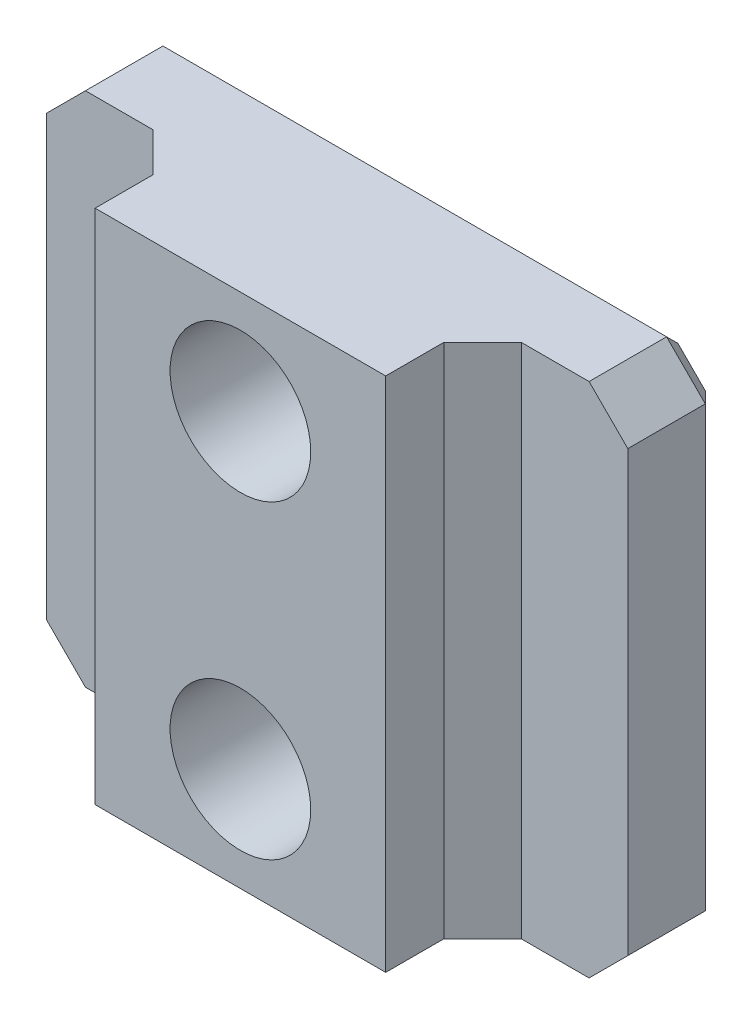
ISO-10303-21;
HEADER;
FILE_DESCRIPTION(('STEP AP214'),'2;1');
FILE_NAME('part.step','',(''),(''),'','','');
FILE_SCHEMA(('AUTOMOTIVE_DESIGN { 1 0 10303 214 1 1 1 1 }'));
ENDSEC;
DATA;
#1=APPLICATION_CONTEXT('core data for automotive mechanical design processes');
#2=APPLICATION_PROTOCOL_DEFINITION('international standard','automotive_design',2000,#1);
#3=PRODUCT_CONTEXT('',#1,'mechanical');
#4=PRODUCT('Part','Part','',(#3));
#5=PRODUCT_RELATED_PRODUCT_CATEGORY('part','',(#4));
#6=PRODUCT_DEFINITION_FORMATION('','',#4);
#7=PRODUCT_DEFINITION_CONTEXT('part definition',#1,'design');
#8=PRODUCT_DEFINITION('design','',#6,#7);
#9=PRODUCT_DEFINITION_SHAPE('','',#8);
#10=(LENGTH_UNIT() NAMED_UNIT(*) SI_UNIT(.MILLI.,.METRE.));
#11=(NAMED_UNIT(*) PLANE_ANGLE_UNIT() SI_UNIT($,.RADIAN.));
#12=(NAMED_UNIT(*) SI_UNIT($,.STERADIAN.) SOLID_ANGLE_UNIT());
#13=UNCERTAINTY_MEASURE_WITH_UNIT(LENGTH_MEASURE(1.E-05),#10,'distance_accuracy_value','');
#14=(GEOMETRIC_REPRESENTATION_CONTEXT(3) GLOBAL_UNCERTAINTY_ASSIGNED_CONTEXT((#13)) GLOBAL_UNIT_ASSIGNED_CONTEXT((#10,
#11,#12)) REPRESENTATION_CONTEXT('',''));
#15=CARTESIAN_POINT('',(0.,0.,0.));
#16=DIRECTION('',(0.,0.,1.));
#17=DIRECTION('',(1.,0.,0.));
#18=AXIS2_PLACEMENT_3D('',#15,#16,#17);
#19=CARTESIAN_POINT('',(0.,7.49400541621981E-13,12.6999999999996));
#20=DIRECTION('',(0.,0.,1.));
#21=DIRECTION('',(1.,0.,0.));
#22=AXIS2_PLACEMENT_3D('',#19,#20,#21);
#23=PLANE('',#22);
#24=DIRECTION('',(0.,-1.,0.));
#25=VECTOR('',#24,1.);
#26=CARTESIAN_POINT('',(-114.479465969192,38.3462946899985,12.6999999999998));
#27=LINE('',#26,#25);
#28=CARTESIAN_POINT('',(-114.479465969192,38.3462946899985,12.6999999999998));
#29=VERTEX_POINT('',#28);
#30=CARTESIAN_POINT('',(-114.479465969192,4.47870530998759,12.6999999999979));
#31=VERTEX_POINT('',#30);
#32=EDGE_CURVE('E166',#29,#31,#27,.T.);
#33=ORIENTED_EDGE('',*,*,#32,.F.);
#34=DIRECTION('',(-1.,0.,0.));
#35=VECTOR('',#34,1.);
#36=CARTESIAN_POINT('',(-104.954465969192,38.3462946899983,12.6999999999979));
#37=LINE('',#36,#35);
#38=CARTESIAN_POINT('',(-133.529465969192,38.3462946899986,12.6999999999999));
#39=VERTEX_POINT('',#38);
#40=EDGE_CURVE('E180',#29,#39,#37,.T.);
#41=ORIENTED_EDGE('',*,*,#40,.T.);
#42=DIRECTION('',(0.,-1.,0.));
#43=VECTOR('',#42,1.);
#44=CARTESIAN_POINT('',(-133.529465969192,38.3462946899989,12.6999999999998));
#45=LINE('',#44,#43);
#46=CARTESIAN_POINT('',(-133.529465969192,4.47870530998753,12.6999999999993));
#47=VERTEX_POINT('',#46);
#48=EDGE_CURVE('E318',#39,#47,#45,.T.);
#49=ORIENTED_EDGE('',*,*,#48,.T.);
#50=DIRECTION('',(1.,0.,0.));
#51=VECTOR('',#50,1.);
#52=CARTESIAN_POINT('',(-143.054465969192,4.47870530998777,12.7));
#53=LINE('',#52,#51);
#54=EDGE_CURVE('E182',#47,#31,#53,.T.);
#55=ORIENTED_EDGE('',*,*,#54,.T.);
#56=EDGE_LOOP('',(#33,#41,#49,#55));
#57=FACE_BOUND('',#56,.T.);
#58=CARTESIAN_POINT('',(-124.004465969192,11.2524999999869,12.6999999999991));
#59=DIRECTION('',(0.,0.,1.));
#60=DIRECTION('',(1.,0.,0.));
#61=AXIS2_PLACEMENT_3D('',#58,#59,#60);
#62=CIRCLE('',#61,4.61010000000002);
#63=CARTESIAN_POINT('',(-119.394365969192,11.2524999999869,12.6999999999991));
#64=VERTEX_POINT('',#63);
#65=EDGE_CURVE('E320',#64,#64,#62,.T.);
#66=ORIENTED_EDGE('',*,*,#65,.F.);
#67=EDGE_LOOP('',(#66));
#68=FACE_BOUND('',#67,.T.);
#69=CARTESIAN_POINT('',(-124.004465969192,31.5724999999854,12.6999999999983));
#70=DIRECTION('',(0.,0.,1.));
#71=DIRECTION('',(1.,0.,0.));
#72=AXIS2_PLACEMENT_3D('',#69,#70,#71);
#73=CIRCLE('',#72,4.61010000000002);
#74=CARTESIAN_POINT('',(-119.394365969192,31.5724999999854,12.6999999999983));
#75=VERTEX_POINT('',#74);
#76=EDGE_CURVE('E205',#75,#75,#73,.T.);
#77=ORIENTED_EDGE('',*,*,#76,.F.);
#78=EDGE_LOOP('',(#77));
#79=FACE_BOUND('',#78,.T.);
#80=ADVANCED_FACE('F36',(#57,#68,#79),#23,.T.);
#81=CARTESIAN_POINT('',(0.,0.,0.));
#82=DIRECTION('',(0.,0.,1.));
#83=DIRECTION('',(1.,0.,0.));
#84=AXIS2_PLACEMENT_3D('',#81,#82,#83);
#85=PLANE('',#84);
#86=DIRECTION('',(-1.,0.,0.));
#87=VECTOR('',#86,1.);
#88=CARTESIAN_POINT('',(0.,5.74870530998726,-3.88578058618805E-13));
#89=LINE('',#88,#87);
#90=CARTESIAN_POINT('',(-108.020517193406,5.74870530998775,2.77555756156289E-13));
#91=VERTEX_POINT('',#90);
#92=CARTESIAN_POINT('',(-139.988414744978,5.74870530998783,-1.02695629777827E-12));
#93=VERTEX_POINT('',#92);
#94=EDGE_CURVE('E259',#91,#93,#89,.T.);
#95=ORIENTED_EDGE('',*,*,#94,.T.);
#96=DIRECTION('',(-0.70710678118655,0.707106781186547,0.));
#97=VECTOR('',#96,1.);
#98=CARTESIAN_POINT('',(-142.156440357085,7.91673092209599,-1.69309011255336E-12));
#99=LINE('',#98,#97);
#100=CARTESIAN_POINT('',(-141.784465969192,7.54475653420246,-1.27675647831893E-12));
#101=VERTEX_POINT('',#100);
#102=EDGE_CURVE('E261',#93,#101,#99,.T.);
#103=ORIENTED_EDGE('',*,*,#102,.T.);
#104=DIRECTION('',(0.,1.,0.));
#105=VECTOR('',#104,1.);
#106=CARTESIAN_POINT('',(-141.784465969192,0.,0.));
#107=LINE('',#106,#105);
#108=CARTESIAN_POINT('',(-141.784465969192,35.2802434657848,-2.4980018054066E-12));
#109=VERTEX_POINT('',#108);
#110=EDGE_CURVE('E247',#101,#109,#107,.T.);
#111=ORIENTED_EDGE('',*,*,#110,.T.);
#112=DIRECTION('',(0.707106781186548,0.707106781186548,0.));
#113=VECTOR('',#112,1.);
#114=CARTESIAN_POINT('',(-139.616440357085,37.4482690778922,0.));
#115=LINE('',#114,#113);
#116=CARTESIAN_POINT('',(-139.988414744978,37.0762946900003,-9.99200722162641E-13));
#117=VERTEX_POINT('',#116);
#118=EDGE_CURVE('E249',#109,#117,#115,.T.);
#119=ORIENTED_EDGE('',*,*,#118,.T.);
#120=DIRECTION('',(1.,0.,0.));
#121=VECTOR('',#120,1.);
#122=CARTESIAN_POINT('',(0.,37.0762946899989,-1.16573417585641E-12));
#123=LINE('',#122,#121);
#124=CARTESIAN_POINT('',(-108.020517193406,37.0762946899994,-8.88178419700125E-13));
#125=VERTEX_POINT('',#124);
#126=EDGE_CURVE('E251',#117,#125,#123,.T.);
#127=ORIENTED_EDGE('',*,*,#126,.T.);
#128=DIRECTION('',(0.707106781186545,-0.707106781186547,0.));
#129=VECTOR('',#128,1.);
#130=CARTESIAN_POINT('',(-105.852491581299,34.9082690778918,-1.11022302462516E-13));
#131=LINE('',#130,#129);
#132=CARTESIAN_POINT('',(-106.224465969192,35.2802434657849,-1.33226762955019E-12));
#133=VERTEX_POINT('',#132);
#134=EDGE_CURVE('E253',#125,#133,#131,.T.);
#135=ORIENTED_EDGE('',*,*,#134,.T.);
#136=DIRECTION('',(0.,-1.,0.));
#137=VECTOR('',#136,1.);
#138=CARTESIAN_POINT('',(-106.224465969192,-1.2490009027033E-13,4.71844785465692E-13));
#139=LINE('',#138,#137);
#140=CARTESIAN_POINT('',(-106.224465969192,7.54475653420256,-2.22044604925031E-13));
#141=VERTEX_POINT('',#140);
#142=EDGE_CURVE('E255',#133,#141,#139,.T.);
#143=ORIENTED_EDGE('',*,*,#142,.T.);
#144=DIRECTION('',(-0.707106781186551,-0.707106781186547,0.));
#145=VECTOR('',#144,1.);
#146=CARTESIAN_POINT('',(-108.392491581299,5.37673092209461,-1.08246744900953E-12));
#147=LINE('',#146,#145);
#148=EDGE_CURVE('E257',#141,#91,#147,.T.);
#149=ORIENTED_EDGE('',*,*,#148,.T.);
#150=EDGE_LOOP('',(#95,#103,#111,#119,#127,#135,#143,#149));
#151=FACE_BOUND('',#150,.T.);
#152=CARTESIAN_POINT('',(-124.004465969192,11.252499999985,-1.94289029309402E-13));
#153=DIRECTION('',(0.,0.,-1.));
#154=DIRECTION('',(-1.,0.,0.));
#155=AXIS2_PLACEMENT_3D('',#152,#153,#154);
#156=CIRCLE('',#155,3.57123999999999);
#157=CARTESIAN_POINT('',(-127.575705969192,11.252499999985,-1.92504836515894E-13));
#158=VERTEX_POINT('',#157);
#159=EDGE_CURVE('E201',#158,#158,#156,.T.);
#160=ORIENTED_EDGE('',*,*,#159,.F.);
#161=EDGE_LOOP('',(#160));
#162=FACE_BOUND('',#161,.T.);
#163=CARTESIAN_POINT('',(-124.004465969192,31.5724999999853,-6.10622663543836E-13));
#164=DIRECTION('',(0.,0.,-1.));
#165=DIRECTION('',(-1.,0.,0.));
#166=AXIS2_PLACEMENT_3D('',#163,#164,#165);
#167=CIRCLE('',#166,3.57123999999999);
#168=CARTESIAN_POINT('',(-127.575705969192,31.5724999999853,-6.08838470750328E-13));
#169=VERTEX_POINT('',#168);
#170=EDGE_CURVE('E194',#169,#169,#167,.T.);
#171=ORIENTED_EDGE('',*,*,#170,.F.);
#172=EDGE_LOOP('',(#171));
#173=FACE_BOUND('',#172,.T.);
#174=ADVANCED_FACE('F335',(#151,#162,#173),#85,.F.);
#175=CARTESIAN_POINT('',(-143.054465969192,38.3462946899986,12.7000000000011));
#176=DIRECTION('',(1.,0.,0.));
#177=DIRECTION('',(0.,1.,0.));
#178=AXIS2_PLACEMENT_3D('',#175,#176,#177);
#179=PLANE('',#178);
#180=DIRECTION('',(0.,0.,-1.));
#181=VECTOR('',#180,1.);
#182=CARTESIAN_POINT('',(-143.054465969192,35.8062946899993,12.7000000000007));
#183=LINE('',#182,#181);
#184=CARTESIAN_POINT('',(-143.054465969192,35.8062946899999,6.35000000000072));
#185=VERTEX_POINT('',#184);
#186=CARTESIAN_POINT('',(-143.054465969192,35.8062946899996,1.27000000000116));
#187=VERTEX_POINT('',#186);
#188=EDGE_CURVE('E223',#185,#187,#183,.T.);
#189=ORIENTED_EDGE('',*,*,#188,.T.);
#190=DIRECTION('',(0.,-1.,0.));
#191=VECTOR('',#190,1.);
#192=CARTESIAN_POINT('',(-143.054465969192,38.346294689999,1.2700000000006));
#193=LINE('',#192,#191);
#194=CARTESIAN_POINT('',(-143.054465969192,7.01870530998842,1.27000000000022));
#195=VERTEX_POINT('',#194);
#196=EDGE_CURVE('E11',#187,#195,#193,.T.);
#197=ORIENTED_EDGE('',*,*,#196,.T.);
#198=DIRECTION('',(0.,0.,1.));
#199=VECTOR('',#198,1.);
#200=CARTESIAN_POINT('',(-143.054465969192,7.01870530998841,12.7000000000002));
#201=LINE('',#200,#199);
#202=CARTESIAN_POINT('',(-143.054465969192,7.0187053099893,6.35000000000074));
#203=VERTEX_POINT('',#202);
#204=EDGE_CURVE('E221',#195,#203,#201,.T.);
#205=ORIENTED_EDGE('',*,*,#204,.T.);
#206=DIRECTION('',(0.,-1.,0.));
#207=VECTOR('',#206,1.);
#208=CARTESIAN_POINT('',(-143.054465969192,38.3462946899989,6.35000000000027));
#209=LINE('',#208,#207);
#210=EDGE_CURVE('E314',#185,#203,#209,.T.);
#211=ORIENTED_EDGE('',*,*,#210,.F.);
#212=EDGE_LOOP('',(#189,#197,#205,#211));
#213=FACE_BOUND('',#212,.T.);
#214=ADVANCED_FACE('F337',(#213),#179,.F.);
#215=CARTESIAN_POINT('',(-143.054465969192,4.47870530998777,12.7));
#216=DIRECTION('',(0.,1.,0.));
#217=DIRECTION('',(-1.,0.,0.));
#218=AXIS2_PLACEMENT_3D('',#215,#216,#217);
#219=PLANE('',#218);
#220=DIRECTION('',(0.,0.,-1.));
#221=VECTOR('',#220,1.);
#222=CARTESIAN_POINT('',(-140.514465969192,4.4787053099877,12.6999999999979));
#223=LINE('',#222,#221);
#224=CARTESIAN_POINT('',(-140.514465969192,4.47870530998772,6.34999999999836));
#225=VERTEX_POINT('',#224);
#226=CARTESIAN_POINT('',(-140.514465969192,4.47870530998799,1.26999999999949));
#227=VERTEX_POINT('',#226);
#228=EDGE_CURVE('E236',#225,#227,#223,.T.);
#229=ORIENTED_EDGE('',*,*,#228,.T.);
#230=DIRECTION('',(1.,0.,0.));
#231=VECTOR('',#230,1.);
#232=CARTESIAN_POINT('',(-143.054465969192,4.47870530998802,1.27000000000077));
#233=LINE('',#232,#231);
#234=CARTESIAN_POINT('',(-107.494465969192,4.47870530998781,1.26999999999999));
#235=VERTEX_POINT('',#234);
#236=EDGE_CURVE('E267',#227,#235,#233,.T.);
#237=ORIENTED_EDGE('',*,*,#236,.T.);
#238=DIRECTION('',(0.,0.,1.));
#239=VECTOR('',#238,1.);
#240=CARTESIAN_POINT('',(-107.494465969192,4.47870530998759,12.6999999999999));
#241=LINE('',#240,#239);
#242=CARTESIAN_POINT('',(-107.494465969192,4.4787053099879,6.35000000000002));
#243=VERTEX_POINT('',#242);
#244=EDGE_CURVE('E234',#235,#243,#241,.T.);
#245=ORIENTED_EDGE('',*,*,#244,.T.);
#246=DIRECTION('',(1.,0.,0.));
#247=VECTOR('',#246,1.);
#248=CARTESIAN_POINT('',(-104.954465969192,4.47870530998756,6.34999999999752));
#249=LINE('',#248,#247);
#250=CARTESIAN_POINT('',(-111.939465969192,4.47870530998766,6.3499999999983));
#251=VERTEX_POINT('',#250);
#252=EDGE_CURVE('E173',#251,#243,#249,.T.);
#253=ORIENTED_EDGE('',*,*,#252,.F.);
#254=DIRECTION('',(0.707106781186553,0.,-0.707106781186548));
#255=VECTOR('',#254,1.);
#256=CARTESIAN_POINT('',(-130.671965969192,4.47870530998866,25.0825000000007));
#257=LINE('',#256,#255);
#258=CARTESIAN_POINT('',(-114.479465969192,4.47870530998747,8.88999999999846));
#259=VERTEX_POINT('',#258);
#260=EDGE_CURVE('E243',#251,#259,#257,.F.);
#261=ORIENTED_EDGE('',*,*,#260,.T.);
#262=DIRECTION('',(0.,0.,-1.));
#263=VECTOR('',#262,1.);
#264=CARTESIAN_POINT('',(-114.479465969192,4.47870530998769,6.34999999999825));
#265=LINE('',#264,#263);
#266=EDGE_CURVE('E317',#31,#259,#265,.T.);
#267=ORIENTED_EDGE('',*,*,#266,.F.);
#268=ORIENTED_EDGE('',*,*,#54,.F.);
#269=DIRECTION('',(0.,0.,1.));
#270=VECTOR('',#269,1.);
#271=CARTESIAN_POINT('',(-133.529465969192,4.4787053099879,6.35000000000002));
#272=LINE('',#271,#270);
#273=CARTESIAN_POINT('',(-133.529465969192,4.47870530998788,8.89000000000001));
#274=VERTEX_POINT('',#273);
#275=EDGE_CURVE('E304',#274,#47,#272,.T.);
#276=ORIENTED_EDGE('',*,*,#275,.F.);
#277=DIRECTION('',(0.707106781186545,0.,0.70710678118655));
#278=VECTOR('',#277,1.);
#279=CARTESIAN_POINT('',(-136.386965969192,4.47870530998792,6.03249999999966));
#280=LINE('',#279,#278);
#281=CARTESIAN_POINT('',(-136.069465969192,4.47870530998797,6.35000000000019));
#282=VERTEX_POINT('',#281);
#283=EDGE_CURVE('E239',#274,#282,#280,.F.);
#284=ORIENTED_EDGE('',*,*,#283,.T.);
#285=DIRECTION('',(1.,0.,0.));
#286=VECTOR('',#285,1.);
#287=CARTESIAN_POINT('',(-143.054465969192,4.47870530998798,6.35000000000063));
#288=LINE('',#287,#286);
#289=EDGE_CURVE('E298',#225,#282,#288,.T.);
#290=ORIENTED_EDGE('',*,*,#289,.F.);
#291=EDGE_LOOP('',(#229,#237,#245,#253,#261,#267,#268,#276,#284,#290));
#292=FACE_BOUND('',#291,.T.);
#293=ADVANCED_FACE('F344',(#292),#219,.F.);
#294=CARTESIAN_POINT('',(-104.954465969192,4.47870530998741,12.6999999999977));
#295=DIRECTION('',(-1.,0.,0.));
#296=DIRECTION('',(0.,-1.,0.));
#297=AXIS2_PLACEMENT_3D('',#294,#295,#296);
#298=PLANE('',#297);
#299=DIRECTION('',(0.,0.,-1.));
#300=VECTOR('',#299,1.);
#301=CARTESIAN_POINT('',(-104.954465969192,7.01870530998872,12.6999999999975));
#302=LINE('',#301,#300);
#303=CARTESIAN_POINT('',(-104.954465969192,7.01870530998912,6.34999999999852));
#304=VERTEX_POINT('',#303);
#305=CARTESIAN_POINT('',(-104.954465969192,7.01870530998819,1.26999999999755));
#306=VERTEX_POINT('',#305);
#307=EDGE_CURVE('E229',#304,#306,#302,.T.);
#308=ORIENTED_EDGE('',*,*,#307,.T.);
#309=DIRECTION('',(0.,1.,0.));
#310=VECTOR('',#309,1.);
#311=CARTESIAN_POINT('',(-104.954465969192,4.47870530998763,1.26999999999794));
#312=LINE('',#311,#310);
#313=CARTESIAN_POINT('',(-104.954465969192,35.8062946899996,1.26999999999849));
#314=VERTEX_POINT('',#313);
#315=EDGE_CURVE('E271',#306,#314,#312,.T.);
#316=ORIENTED_EDGE('',*,*,#315,.T.);
#317=DIRECTION('',(0.,0.,1.));
#318=VECTOR('',#317,1.);
#319=CARTESIAN_POINT('',(-104.954465969192,35.806294689999,12.699999999999));
#320=LINE('',#319,#318);
#321=CARTESIAN_POINT('',(-104.954465969192,35.8062946900001,6.3499999999983));
#322=VERTEX_POINT('',#321);
#323=EDGE_CURVE('E232',#314,#322,#320,.T.);
#324=ORIENTED_EDGE('',*,*,#323,.T.);
#325=DIRECTION('',(0.,-1.,0.));
#326=VECTOR('',#325,1.);
#327=CARTESIAN_POINT('',(-104.954465969192,38.3462946899987,6.34999999999847));
#328=LINE('',#327,#326);
#329=EDGE_CURVE('E183',#322,#304,#328,.T.);
#330=ORIENTED_EDGE('',*,*,#329,.T.);
#331=EDGE_LOOP('',(#308,#316,#324,#330));
#332=FACE_BOUND('',#331,.T.);
#333=ADVANCED_FACE('F353',(#332),#298,.F.);
#334=CARTESIAN_POINT('',(-104.954465969192,38.3462946899983,12.6999999999979));
#335=DIRECTION('',(0.,-1.,0.));
#336=DIRECTION('',(1.,0.,0.));
#337=AXIS2_PLACEMENT_3D('',#334,#335,#336);
#338=PLANE('',#337);
#339=DIRECTION('',(0.,0.,-1.));
#340=VECTOR('',#339,1.);
#341=CARTESIAN_POINT('',(-107.494465969192,38.3462946899985,12.7000000000001));
#342=LINE('',#341,#340);
#343=CARTESIAN_POINT('',(-107.494465969192,38.3462946899986,6.35000000000022));
#344=VERTEX_POINT('',#343);
#345=CARTESIAN_POINT('',(-107.494465969192,38.3462946899987,1.2700000000001));
#346=VERTEX_POINT('',#345);
#347=EDGE_CURVE('E225',#344,#346,#342,.T.);
#348=ORIENTED_EDGE('',*,*,#347,.T.);
#349=DIRECTION('',(-1.,0.,0.));
#350=VECTOR('',#349,1.);
#351=CARTESIAN_POINT('',(-104.954465969192,38.3462946899988,1.26999999999994));
#352=LINE('',#351,#350);
#353=CARTESIAN_POINT('',(-140.514465969192,38.3462946899992,1.2700000000001));
#354=VERTEX_POINT('',#353);
#355=EDGE_CURVE('E60',#346,#354,#352,.T.);
#356=ORIENTED_EDGE('',*,*,#355,.T.);
#357=DIRECTION('',(0.,0.,1.));
#358=VECTOR('',#357,1.);
#359=CARTESIAN_POINT('',(-140.514465969192,38.3462946899984,12.6999999999984));
#360=LINE('',#359,#358);
#361=CARTESIAN_POINT('',(-140.514465969192,38.3462946899988,6.34999999999997));
#362=VERTEX_POINT('',#361);
#363=EDGE_CURVE('E227',#354,#362,#360,.T.);
#364=ORIENTED_EDGE('',*,*,#363,.T.);
#365=DIRECTION('',(1.,0.,0.));
#366=VECTOR('',#365,1.);
#367=CARTESIAN_POINT('',(-143.054465969192,38.3462946899989,6.35000000000027));
#368=LINE('',#367,#366);
#369=CARTESIAN_POINT('',(-136.069465969192,38.346294689999,6.3499999999998));
#370=VERTEX_POINT('',#369);
#371=EDGE_CURVE('E309',#362,#370,#368,.T.);
#372=ORIENTED_EDGE('',*,*,#371,.T.);
#373=DIRECTION('',(-0.707106781186545,0.,-0.70710678118655));
#374=VECTOR('',#373,1.);
#375=CARTESIAN_POINT('',(-117.336965969192,38.3462946899998,25.0824999999983));
#376=LINE('',#375,#374);
#377=CARTESIAN_POINT('',(-133.529465969192,38.3462946899986,8.89000000000001));
#378=VERTEX_POINT('',#377);
#379=EDGE_CURVE('E241',#370,#378,#376,.F.);
#380=ORIENTED_EDGE('',*,*,#379,.T.);
#381=DIRECTION('',(0.,0.,1.));
#382=VECTOR('',#381,1.);
#383=CARTESIAN_POINT('',(-133.529465969192,38.3462946899986,6.35000000000027));
#384=LINE('',#383,#382);
#385=EDGE_CURVE('E187',#378,#39,#384,.T.);
#386=ORIENTED_EDGE('',*,*,#385,.T.);
#387=ORIENTED_EDGE('',*,*,#40,.F.);
#388=DIRECTION('',(0.,0.,-1.));
#389=VECTOR('',#388,1.);
#390=CARTESIAN_POINT('',(-114.479465969192,38.3462946899988,6.35000000000013));
#391=LINE('',#390,#389);
#392=CARTESIAN_POINT('',(-114.479465969192,38.3462946899984,8.88999999999862));
#393=VERTEX_POINT('',#392);
#394=EDGE_CURVE('E162',#29,#393,#391,.T.);
#395=ORIENTED_EDGE('',*,*,#394,.T.);
#396=DIRECTION('',(-0.707106781186553,0.,0.707106781186548));
#397=VECTOR('',#396,1.);
#398=CARTESIAN_POINT('',(-111.621965969192,38.3462946899985,6.03249999999883));
#399=LINE('',#398,#397);
#400=CARTESIAN_POINT('',(-111.939465969192,38.3462946899989,6.35000000000019));
#401=VERTEX_POINT('',#400);
#402=EDGE_CURVE('E245',#393,#401,#399,.F.);
#403=ORIENTED_EDGE('',*,*,#402,.T.);
#404=DIRECTION('',(1.,0.,0.));
#405=VECTOR('',#404,1.);
#406=CARTESIAN_POINT('',(-104.954465969192,38.3462946899987,6.34999999999847));
#407=LINE('',#406,#405);
#408=EDGE_CURVE('E172',#401,#344,#407,.T.);
#409=ORIENTED_EDGE('',*,*,#408,.T.);
#410=EDGE_LOOP('',(#348,#356,#364,#372,#380,#386,#387,#395,#403,#409));
#411=FACE_BOUND('',#410,.T.);
#412=ADVANCED_FACE('F185',(#411),#338,.F.);
#413=CARTESIAN_POINT('',(-124.004465969192,31.5724999999853,-6.10622663543836E-13));
#414=DIRECTION('',(0.,0.,-1.));
#415=DIRECTION('',(-1.,0.,0.));
#416=AXIS2_PLACEMENT_3D('',#413,#414,#415);
#417=CYLINDRICAL_SURFACE('',#416,3.57124);
#418=CARTESIAN_POINT('',(-124.004465969192,31.5724999999851,5.07999999999964));
#419=DIRECTION('',(0.,0.,-1.));
#420=DIRECTION('',(-1.,0.,0.));
#421=AXIS2_PLACEMENT_3D('',#418,#419,#420);
#422=CIRCLE('',#421,3.57124);
#423=CARTESIAN_POINT('',(-127.575705969192,31.5724999999851,5.07999999999964));
#424=VERTEX_POINT('',#423);
#425=EDGE_CURVE('E198',#424,#424,#422,.F.);
#426=ORIENTED_EDGE('',*,*,#425,.T.);
#427=EDGE_LOOP('',(#426));
#428=FACE_BOUND('',#427,.T.);
#429=ORIENTED_EDGE('',*,*,#170,.T.);
#430=EDGE_LOOP('',(#429));
#431=FACE_BOUND('',#430,.T.);
#432=ADVANCED_FACE('F333',(#428,#431),#417,.F.);
#433=CARTESIAN_POINT('',(-124.004465969192,11.252499999985,-1.94289029309402E-13));
#434=DIRECTION('',(0.,0.,-1.));
#435=DIRECTION('',(-1.,0.,0.));
#436=AXIS2_PLACEMENT_3D('',#433,#434,#435);
#437=CYLINDRICAL_SURFACE('',#436,3.57124);
#438=CARTESIAN_POINT('',(-124.004465969192,11.2524999999852,5.07999999999945));
#439=DIRECTION('',(0.,0.,-1.));
#440=DIRECTION('',(-1.,0.,0.));
#441=AXIS2_PLACEMENT_3D('',#438,#439,#440);
#442=CIRCLE('',#441,3.57124);
#443=CARTESIAN_POINT('',(-127.575705969192,11.2524999999853,5.07999999999945));
#444=VERTEX_POINT('',#443);
#445=EDGE_CURVE('E203',#444,#444,#442,.F.);
#446=ORIENTED_EDGE('',*,*,#445,.T.);
#447=EDGE_LOOP('',(#446));
#448=FACE_BOUND('',#447,.T.);
#449=ORIENTED_EDGE('',*,*,#159,.T.);
#450=EDGE_LOOP('',(#449));
#451=FACE_BOUND('',#450,.T.);
#452=ADVANCED_FACE('F487',(#448,#451),#437,.F.);
#453=CARTESIAN_POINT('',(-124.004465969192,31.5724999999851,5.07999999999964));
#454=DIRECTION('',(0.,0.,-1.));
#455=DIRECTION('',(-1.,0.,0.));
#456=AXIS2_PLACEMENT_3D('',#453,#454,#455);
#457=PLANE('',#456);
#458=CARTESIAN_POINT('',(-124.004465969192,31.5724999999851,5.07999999999964));
#459=DIRECTION('',(0.,0.,1.));
#460=DIRECTION('',(1.,0.,0.));
#461=AXIS2_PLACEMENT_3D('',#458,#459,#460);
#462=CIRCLE('',#461,4.43230000000001);
#463=CARTESIAN_POINT('',(-119.572165969192,31.5724999999851,5.07999999999964));
#464=VERTEX_POINT('',#463);
#465=EDGE_CURVE('E202',#464,#464,#462,.T.);
#466=ORIENTED_EDGE('',*,*,#465,.T.);
#467=EDGE_LOOP('',(#466));
#468=FACE_BOUND('',#467,.T.);
#469=ORIENTED_EDGE('',*,*,#425,.F.);
#470=EDGE_LOOP('',(#469));
#471=FACE_BOUND('',#470,.T.);
#472=ADVANCED_FACE('F483',(#468,#471),#457,.F.);
#473=CARTESIAN_POINT('',(-124.004465969192,31.5724999999854,12.6999999999983));
#474=DIRECTION('',(0.,0.,1.));
#475=DIRECTION('',(1.,0.,0.));
#476=AXIS2_PLACEMENT_3D('',#473,#474,#475);
#477=CONICAL_SURFACE('',#476,4.61010000000002,0.0233291001481873);
#478=ORIENTED_EDGE('',*,*,#465,.F.);
#479=EDGE_LOOP('',(#478));
#480=FACE_BOUND('',#479,.T.);
#481=ORIENTED_EDGE('',*,*,#76,.T.);
#482=EDGE_LOOP('',(#481));
#483=FACE_BOUND('',#482,.T.);
#484=ADVANCED_FACE('F479',(#480,#483),#477,.F.);
#485=CARTESIAN_POINT('',(-124.004465969192,11.2524999999852,5.07999999999945));
#486=DIRECTION('',(0.,0.,-1.));
#487=DIRECTION('',(-1.,0.,0.));
#488=AXIS2_PLACEMENT_3D('',#485,#486,#487);
#489=PLANE('',#488);
#490=CARTESIAN_POINT('',(-124.004465969192,11.2524999999852,5.07999999999945));
#491=DIRECTION('',(0.,0.,1.));
#492=DIRECTION('',(1.,0.,0.));
#493=AXIS2_PLACEMENT_3D('',#490,#491,#492);
#494=CIRCLE('',#493,4.43230000000001);
#495=CARTESIAN_POINT('',(-119.572165969192,11.2524999999852,5.07999999999944));
#496=VERTEX_POINT('',#495);
#497=EDGE_CURVE('E206',#496,#496,#494,.T.);
#498=ORIENTED_EDGE('',*,*,#497,.T.);
#499=EDGE_LOOP('',(#498));
#500=FACE_BOUND('',#499,.T.);
#501=ORIENTED_EDGE('',*,*,#445,.F.);
#502=EDGE_LOOP('',(#501));
#503=FACE_BOUND('',#502,.T.);
#504=ADVANCED_FACE('F475',(#500,#503),#489,.F.);
#505=CARTESIAN_POINT('',(-124.004465969192,11.2524999999869,12.6999999999991));
#506=DIRECTION('',(0.,0.,1.));
#507=DIRECTION('',(1.,0.,0.));
#508=AXIS2_PLACEMENT_3D('',#505,#506,#507);
#509=CONICAL_SURFACE('',#508,4.61010000000002,0.0233291001481873);
#510=ORIENTED_EDGE('',*,*,#497,.F.);
#511=EDGE_LOOP('',(#510));
#512=FACE_BOUND('',#511,.T.);
#513=ORIENTED_EDGE('',*,*,#65,.T.);
#514=EDGE_LOOP('',(#513));
#515=FACE_BOUND('',#514,.T.);
#516=ADVANCED_FACE('F469',(#512,#515),#509,.F.);
#517=CARTESIAN_POINT('',(-143.054465969192,38.3462946899989,6.35000000000027));
#518=DIRECTION('',(0.,0.,-1.));
#519=DIRECTION('',(-1.,0.,0.));
#520=AXIS2_PLACEMENT_3D('',#517,#518,#519);
#521=PLANE('',#520);
#522=ORIENTED_EDGE('',*,*,#289,.T.);
#523=DIRECTION('',(0.,1.,0.));
#524=VECTOR('',#523,1.);
#525=CARTESIAN_POINT('',(-136.069465969192,38.346294689999,6.3499999999998));
#526=LINE('',#525,#524);
#527=EDGE_CURVE('E211',#282,#370,#526,.T.);
#528=ORIENTED_EDGE('',*,*,#527,.T.);
#529=ORIENTED_EDGE('',*,*,#371,.F.);
#530=DIRECTION('',(0.707106781186548,0.707106781186548,0.));
#531=VECTOR('',#530,1.);
#532=CARTESIAN_POINT('',(-143.054465969192,35.8062946899997,6.3500000000008));
#533=LINE('',#532,#531);
#534=EDGE_CURVE('E209',#362,#185,#533,.F.);
#535=ORIENTED_EDGE('',*,*,#534,.T.);
#536=ORIENTED_EDGE('',*,*,#210,.T.);
#537=DIRECTION('',(-0.70710678118655,0.707106781186547,0.));
#538=VECTOR('',#537,1.);
#539=CARTESIAN_POINT('',(-140.514465969192,4.47870530998772,6.34999999999836));
#540=LINE('',#539,#538);
#541=EDGE_CURVE('E192',#203,#225,#540,.F.);
#542=ORIENTED_EDGE('',*,*,#541,.T.);
#543=EDGE_LOOP('',(#522,#528,#529,#535,#536,#542));
#544=FACE_BOUND('',#543,.T.);
#545=ADVANCED_FACE('F462',(#544),#521,.F.);
#546=CARTESIAN_POINT('',(-133.529465969192,38.3462946899986,6.35000000000027));
#547=DIRECTION('',(1.,0.,0.));
#548=DIRECTION('',(0.,1.,0.));
#549=AXIS2_PLACEMENT_3D('',#546,#547,#548);
#550=PLANE('',#549);
#551=ORIENTED_EDGE('',*,*,#385,.F.);
#552=DIRECTION('',(0.,-1.,0.));
#553=VECTOR('',#552,1.);
#554=CARTESIAN_POINT('',(-133.529465969192,4.47870530998788,8.89000000000001));
#555=LINE('',#554,#553);
#556=EDGE_CURVE('E189',#378,#274,#555,.T.);
#557=ORIENTED_EDGE('',*,*,#556,.T.);
#558=ORIENTED_EDGE('',*,*,#275,.T.);
#559=ORIENTED_EDGE('',*,*,#48,.F.);
#560=EDGE_LOOP('',(#551,#557,#558,#559));
#561=FACE_BOUND('',#560,.T.);
#562=ADVANCED_FACE('F460',(#561),#550,.F.);
#563=CARTESIAN_POINT('',(-104.954465969192,38.3462946899987,6.34999999999847));
#564=DIRECTION('',(0.,0.,-1.));
#565=DIRECTION('',(-1.,0.,0.));
#566=AXIS2_PLACEMENT_3D('',#563,#564,#565);
#567=PLANE('',#566);
#568=ORIENTED_EDGE('',*,*,#408,.F.);
#569=DIRECTION('',(0.,-1.,0.));
#570=VECTOR('',#569,1.);
#571=CARTESIAN_POINT('',(-111.939465969192,4.47870530998766,6.3499999999983));
#572=LINE('',#571,#570);
#573=EDGE_CURVE('E217',#401,#251,#572,.T.);
#574=ORIENTED_EDGE('',*,*,#573,.T.);
#575=ORIENTED_EDGE('',*,*,#252,.T.);
#576=DIRECTION('',(-0.707106781186551,-0.707106781186547,0.));
#577=VECTOR('',#576,1.);
#578=CARTESIAN_POINT('',(-104.954465969192,7.01870530998894,6.3499999999988));
#579=LINE('',#578,#577);
#580=EDGE_CURVE('E213',#243,#304,#579,.F.);
#581=ORIENTED_EDGE('',*,*,#580,.T.);
#582=ORIENTED_EDGE('',*,*,#329,.F.);
#583=DIRECTION('',(0.707106781186545,-0.707106781186547,0.));
#584=VECTOR('',#583,1.);
#585=CARTESIAN_POINT('',(-107.494465969192,38.3462946899986,6.35000000000024));
#586=LINE('',#585,#584);
#587=EDGE_CURVE('E215',#322,#344,#586,.F.);
#588=ORIENTED_EDGE('',*,*,#587,.T.);
#589=EDGE_LOOP('',(#568,#574,#575,#581,#582,#588));
#590=FACE_BOUND('',#589,.T.);
#591=ADVANCED_FACE('F447',(#590),#567,.F.);
#592=CARTESIAN_POINT('',(-114.479465969192,38.3462946899988,6.35000000000013));
#593=DIRECTION('',(-1.,0.,0.));
#594=DIRECTION('',(0.,-1.,0.));
#595=AXIS2_PLACEMENT_3D('',#592,#593,#594);
#596=PLANE('',#595);
#597=ORIENTED_EDGE('',*,*,#266,.T.);
#598=DIRECTION('',(0.,1.,0.));
#599=VECTOR('',#598,1.);
#600=CARTESIAN_POINT('',(-114.479465969192,38.3462946899984,8.88999999999857));
#601=LINE('',#600,#599);
#602=EDGE_CURVE('E169',#259,#393,#601,.T.);
#603=ORIENTED_EDGE('',*,*,#602,.T.);
#604=ORIENTED_EDGE('',*,*,#394,.F.);
#605=ORIENTED_EDGE('',*,*,#32,.T.);
#606=EDGE_LOOP('',(#597,#603,#604,#605));
#607=FACE_BOUND('',#606,.T.);
#608=ADVANCED_FACE('F165',(#607),#596,.F.);
#609=CARTESIAN_POINT('',(-133.529465969192,38.3462946899986,8.89000000000001));
#610=DIRECTION('',(-0.70710678118655,0.,0.707106781186548));
#611=DIRECTION('',(0.,1.,0.));
#612=AXIS2_PLACEMENT_3D('',#609,#610,#611);
#613=PLANE('',#612);
#614=ORIENTED_EDGE('',*,*,#379,.F.);
#615=ORIENTED_EDGE('',*,*,#527,.F.);
#616=ORIENTED_EDGE('',*,*,#283,.F.);
#617=ORIENTED_EDGE('',*,*,#556,.F.);
#618=EDGE_LOOP('',(#614,#615,#616,#617));
#619=FACE_BOUND('',#618,.T.);
#620=ADVANCED_FACE('F360',(#619),#613,.T.);
#621=CARTESIAN_POINT('',(-111.939465969192,38.3462946899989,6.35000000000019));
#622=DIRECTION('',(0.707106781186544,0.,0.707106781186553));
#623=DIRECTION('',(0.,1.,0.));
#624=AXIS2_PLACEMENT_3D('',#621,#622,#623);
#625=PLANE('',#624);
#626=ORIENTED_EDGE('',*,*,#402,.F.);
#627=ORIENTED_EDGE('',*,*,#602,.F.);
#628=ORIENTED_EDGE('',*,*,#260,.F.);
#629=ORIENTED_EDGE('',*,*,#573,.F.);
#630=EDGE_LOOP('',(#626,#627,#628,#629));
#631=FACE_BOUND('',#630,.T.);
#632=ADVANCED_FACE('F363',(#631),#625,.T.);
#633=CARTESIAN_POINT('',(-143.054465969192,35.8062946899993,12.7000000000007));
#634=DIRECTION('',(0.707106781186548,-0.707106781186547,0.));
#635=DIRECTION('',(0.,0.,-1.));
#636=AXIS2_PLACEMENT_3D('',#633,#634,#635);
#637=PLANE('',#636);
#638=ORIENTED_EDGE('',*,*,#363,.F.);
#639=DIRECTION('',(0.707106781186548,0.707106781186548,0.));
#640=VECTOR('',#639,1.);
#641=CARTESIAN_POINT('',(-143.054465969192,35.8062946899996,1.27000000000116));
#642=LINE('',#641,#640);
#643=EDGE_CURVE('E45',#354,#187,#642,.F.);
#644=ORIENTED_EDGE('',*,*,#643,.T.);
#645=ORIENTED_EDGE('',*,*,#188,.F.);
#646=ORIENTED_EDGE('',*,*,#534,.F.);
#647=EDGE_LOOP('',(#638,#644,#645,#646));
#648=FACE_BOUND('',#647,.T.);
#649=ADVANCED_FACE('F367',(#648),#637,.F.);
#650=CARTESIAN_POINT('',(-107.494465969192,38.3462946899985,12.7000000000001));
#651=DIRECTION('',(-0.707106781186551,-0.707106781186547,0.));
#652=DIRECTION('',(0.,0.,-1.));
#653=AXIS2_PLACEMENT_3D('',#650,#651,#652);
#654=PLANE('',#653);
#655=ORIENTED_EDGE('',*,*,#323,.F.);
#656=DIRECTION('',(0.707106781186545,-0.707106781186547,0.));
#657=VECTOR('',#656,1.);
#658=CARTESIAN_POINT('',(-107.494465969192,38.3462946899987,1.2700000000001));
#659=LINE('',#658,#657);
#660=EDGE_CURVE('E273',#314,#346,#659,.F.);
#661=ORIENTED_EDGE('',*,*,#660,.T.);
#662=ORIENTED_EDGE('',*,*,#347,.F.);
#663=ORIENTED_EDGE('',*,*,#587,.F.);
#664=EDGE_LOOP('',(#655,#661,#662,#663));
#665=FACE_BOUND('',#664,.T.);
#666=ADVANCED_FACE('F371',(#665),#654,.F.);
#667=CARTESIAN_POINT('',(-140.514465969192,4.4787053099877,12.6999999999979));
#668=DIRECTION('',(0.707106781186546,0.707106781186554,0.));
#669=DIRECTION('',(0.,0.,-1.));
#670=AXIS2_PLACEMENT_3D('',#667,#668,#669);
#671=PLANE('',#670);
#672=ORIENTED_EDGE('',*,*,#204,.F.);
#673=DIRECTION('',(-0.70710678118655,0.707106781186547,0.));
#674=VECTOR('',#673,1.);
#675=CARTESIAN_POINT('',(-140.514465969192,4.47870530998801,1.26999999999938));
#676=LINE('',#675,#674);
#677=EDGE_CURVE('E264',#195,#227,#676,.F.);
#678=ORIENTED_EDGE('',*,*,#677,.T.);
#679=ORIENTED_EDGE('',*,*,#228,.F.);
#680=ORIENTED_EDGE('',*,*,#541,.F.);
#681=EDGE_LOOP('',(#672,#678,#679,#680));
#682=FACE_BOUND('',#681,.T.);
#683=ADVANCED_FACE('F374',(#682),#671,.F.);
#684=CARTESIAN_POINT('',(-104.954465969192,7.01870530998872,12.6999999999975));
#685=DIRECTION('',(-0.707106781186547,0.707106781186552,0.));
#686=DIRECTION('',(0.,0.,-1.));
#687=AXIS2_PLACEMENT_3D('',#684,#685,#686);
#688=PLANE('',#687);
#689=ORIENTED_EDGE('',*,*,#244,.F.);
#690=DIRECTION('',(-0.707106781186551,-0.707106781186547,0.));
#691=VECTOR('',#690,1.);
#692=CARTESIAN_POINT('',(-104.954465969192,7.01870530998819,1.26999999999755));
#693=LINE('',#692,#691);
#694=EDGE_CURVE('E269',#235,#306,#693,.F.);
#695=ORIENTED_EDGE('',*,*,#694,.T.);
#696=ORIENTED_EDGE('',*,*,#307,.F.);
#697=ORIENTED_EDGE('',*,*,#580,.F.);
#698=EDGE_LOOP('',(#689,#695,#696,#697));
#699=FACE_BOUND('',#698,.T.);
#700=ADVANCED_FACE('F378',(#699),#688,.F.);
#701=CARTESIAN_POINT('',(-35.4721112517041,-35.4721112517039,0.));
#702=DIRECTION('',(-0.500000000000005,-0.5,0.707106781186544));
#703=DIRECTION('',(0.707106781186545,-0.707106781186547,0.));
#704=AXIS2_PLACEMENT_3D('',#701,#702,#703);
#705=PLANE('',#704);
#706=DIRECTION('',(-0.281084637714821,-0.678598344545858,-0.678598344545851));
#707=VECTOR('',#706,1.);
#708=CARTESIAN_POINT('',(-107.293784192351,38.8307833573683,1.75448866736966));
#709=LINE('',#708,#707);
#710=EDGE_CURVE('E292',#346,#125,#709,.T.);
#711=ORIENTED_EDGE('',*,*,#710,.F.);
#712=ORIENTED_EDGE('',*,*,#660,.F.);
#713=DIRECTION('',(-0.678598344545856,-0.281084637714817,-0.678598344545857));
#714=VECTOR('',#713,1.);
#715=CARTESIAN_POINT('',(-87.138866634273,43.1857575563277,19.0855993349191));
#716=LINE('',#715,#714);
#717=EDGE_CURVE('E40',#133,#314,#716,.F.);
#718=ORIENTED_EDGE('',*,*,#717,.F.);
#719=ORIENTED_EDGE('',*,*,#134,.F.);
#720=EDGE_LOOP('',(#711,#712,#718,#719));
#721=FACE_BOUND('',#720,.T.);
#722=ADVANCED_FACE('F38',(#721),#705,.F.);
#723=CARTESIAN_POINT('',(-104.954465969192,4.47870530998763,1.26999999999794));
#724=DIRECTION('',(-0.70710678118655,0.,0.707106781186549));
#725=DIRECTION('',(0.,1.,0.));
#726=AXIS2_PLACEMENT_3D('',#723,#724,#725);
#727=PLANE('',#726);
#728=ORIENTED_EDGE('',*,*,#717,.T.);
#729=ORIENTED_EDGE('',*,*,#315,.F.);
#730=DIRECTION('',(-0.678598344545857,0.281084637714815,-0.678598344545853));
#731=VECTOR('',#730,1.);
#732=CARTESIAN_POINT('',(-104.469977301822,6.81802353314756,1.7544886673676));
#733=LINE('',#732,#731);
#734=EDGE_CURVE('E290',#141,#306,#733,.F.);
#735=ORIENTED_EDGE('',*,*,#734,.F.);
#736=ORIENTED_EDGE('',*,*,#142,.F.);
#737=EDGE_LOOP('',(#728,#729,#735,#736));
#738=FACE_BOUND('',#737,.T.);
#739=ADVANCED_FACE('F405',(#738),#727,.F.);
#740=CARTESIAN_POINT('',(-104.954465969192,38.3462946899988,1.26999999999994));
#741=DIRECTION('',(0.,-0.707106781186549,0.70710678118655));
#742=DIRECTION('',(-1.,0.,0.));
#743=AXIS2_PLACEMENT_3D('',#740,#741,#742);
#744=PLANE('',#743);
#745=ORIENTED_EDGE('',*,*,#710,.T.);
#746=ORIENTED_EDGE('',*,*,#126,.F.);
#747=DIRECTION('',(0.281084637714808,-0.678598344545851,-0.678598344545853));
#748=VECTOR('',#747,1.);
#749=CARTESIAN_POINT('',(-145.737857420284,50.9566771728113,13.8803824828113));
#750=LINE('',#749,#748);
#751=EDGE_CURVE('E287',#354,#117,#750,.T.);
#752=ORIENTED_EDGE('',*,*,#751,.F.);
#753=ORIENTED_EDGE('',*,*,#355,.F.);
#754=EDGE_LOOP('',(#745,#746,#752,#753));
#755=FACE_BOUND('',#754,.T.);
#756=ADVANCED_FACE('F402',(#755),#744,.F.);
#757=CARTESIAN_POINT('',(-56.8846112516964,56.8846112516983,0.));
#758=DIRECTION('',(-0.500000000000002,0.500000000000009,0.707106781186545));
#759=DIRECTION('',(-0.707106781186551,-0.707106781186547,0.));
#760=AXIS2_PLACEMENT_3D('',#757,#758,#759);
#761=PLANE('',#760);
#762=ORIENTED_EDGE('',*,*,#734,.T.);
#763=ORIENTED_EDGE('',*,*,#694,.F.);
#764=DIRECTION('',(-0.281084637714813,0.678598344545853,-0.678598344545853));
#765=VECTOR('',#764,1.);
#766=CARTESIAN_POINT('',(-113.734187453131,19.5427255419445,-13.7940202319567));
#767=LINE('',#766,#765);
#768=EDGE_CURVE('E284',#91,#235,#767,.F.);
#769=ORIENTED_EDGE('',*,*,#768,.F.);
#770=ORIENTED_EDGE('',*,*,#148,.F.);
#771=EDGE_LOOP('',(#762,#763,#769,#770));
#772=FACE_BOUND('',#771,.T.);
#773=ADVANCED_FACE('F398',(#772),#761,.F.);
#774=CARTESIAN_POINT('',(-88.5323547174884,88.5323547174884,0.));
#775=DIRECTION('',(0.500000000000005,-0.500000000000007,0.707106781186539));
#776=DIRECTION('',(0.707106781186548,0.707106781186548,0.));
#777=AXIS2_PLACEMENT_3D('',#774,#775,#776);
#778=PLANE('',#777);
#779=ORIENTED_EDGE('',*,*,#751,.T.);
#780=ORIENTED_EDGE('',*,*,#118,.F.);
#781=DIRECTION('',(0.678598344545837,-0.281084637714814,-0.678598344545853));
#782=VECTOR('',#781,1.);
#783=CARTESIAN_POINT('',(-143.538954636562,36.0069764668401,1.75448866736971));
#784=LINE('',#783,#782);
#785=EDGE_CURVE('E281',#187,#109,#784,.T.);
#786=ORIENTED_EDGE('',*,*,#785,.F.);
#787=ORIENTED_EDGE('',*,*,#643,.F.);
#788=EDGE_LOOP('',(#779,#780,#786,#787));
#789=FACE_BOUND('',#788,.T.);
#790=ADVANCED_FACE('F394',(#789),#778,.F.);
#791=CARTESIAN_POINT('',(-143.054465969192,4.47870530998802,1.27000000000077));
#792=DIRECTION('',(0.,0.70710678118655,0.707106781186546));
#793=DIRECTION('',(1.,0.,0.));
#794=AXIS2_PLACEMENT_3D('',#791,#792,#793);
#795=PLANE('',#794);
#796=ORIENTED_EDGE('',*,*,#768,.T.);
#797=ORIENTED_EDGE('',*,*,#236,.F.);
#798=DIRECTION('',(0.281084637714824,0.678598344545853,-0.678598344545853));
#799=VECTOR('',#798,1.);
#800=CARTESIAN_POINT('',(-140.715147746033,3.99421664261804,1.75448866736794));
#801=LINE('',#800,#799);
#802=EDGE_CURVE('E279',#93,#227,#801,.F.);
#803=ORIENTED_EDGE('',*,*,#802,.F.);
#804=ORIENTED_EDGE('',*,*,#94,.F.);
#805=EDGE_LOOP('',(#796,#797,#803,#804));
#806=FACE_BOUND('',#805,.T.);
#807=ADVANCED_FACE('F390',(#806),#795,.F.);
#808=CARTESIAN_POINT('',(-143.054465969192,38.346294689999,1.2700000000006));
#809=DIRECTION('',(0.707106781186551,0.,0.707106781186545));
#810=DIRECTION('',(0.,-1.,0.));
#811=AXIS2_PLACEMENT_3D('',#808,#809,#810);
#812=PLANE('',#811);
#813=ORIENTED_EDGE('',*,*,#785,.T.);
#814=ORIENTED_EDGE('',*,*,#110,.F.);
#815=DIRECTION('',(-0.678598344545833,-0.281084637714831,0.678598344545853));
#816=VECTOR('',#815,1.);
#817=CARTESIAN_POINT('',(-137.078929736663,9.49385345995327,-4.70553623252976));
#818=LINE('',#817,#816);
#819=EDGE_CURVE('E277',#195,#101,#818,.F.);
#820=ORIENTED_EDGE('',*,*,#819,.F.);
#821=ORIENTED_EDGE('',*,*,#196,.F.);
#822=EDGE_LOOP('',(#813,#814,#820,#821));
#823=FACE_BOUND('',#822,.T.);
#824=ADVANCED_FACE('F386',(#823),#812,.F.);
#825=CARTESIAN_POINT('',(-67.1198547174948,-67.1198547174951,7.7715611723761E-13));
#826=DIRECTION('',(0.499999999999999,0.500000000000002,0.707106781186554));
#827=DIRECTION('',(-0.70710678118655,0.707106781186547,0.));
#828=AXIS2_PLACEMENT_3D('',#825,#826,#827);
#829=PLANE('',#828);
#830=ORIENTED_EDGE('',*,*,#802,.T.);
#831=ORIENTED_EDGE('',*,*,#677,.F.);
#832=ORIENTED_EDGE('',*,*,#819,.T.);
#833=ORIENTED_EDGE('',*,*,#102,.F.);
#834=EDGE_LOOP('',(#830,#831,#832,#833));
#835=FACE_BOUND('',#834,.T.);
#836=ADVANCED_FACE('F383',(#835),#829,.F.);
#837=CLOSED_SHELL('',(#80,#174,#214,#293,#333,#412,#432,#452,#472,#484,#504,#516,#545,#562,#591,
#608,#620,#632,#649,#666,#683,#700,#722,#739,#756,#773,#790,#807,#824,#836));
#838=MANIFOLD_SOLID_BREP('B2',#837);
#839=ADVANCED_BREP_SHAPE_REPRESENTATION('',(#18,#838),#14);
#840=SHAPE_DEFINITION_REPRESENTATION(#9,#839);
ENDSEC;
END-ISO-10303-21;
